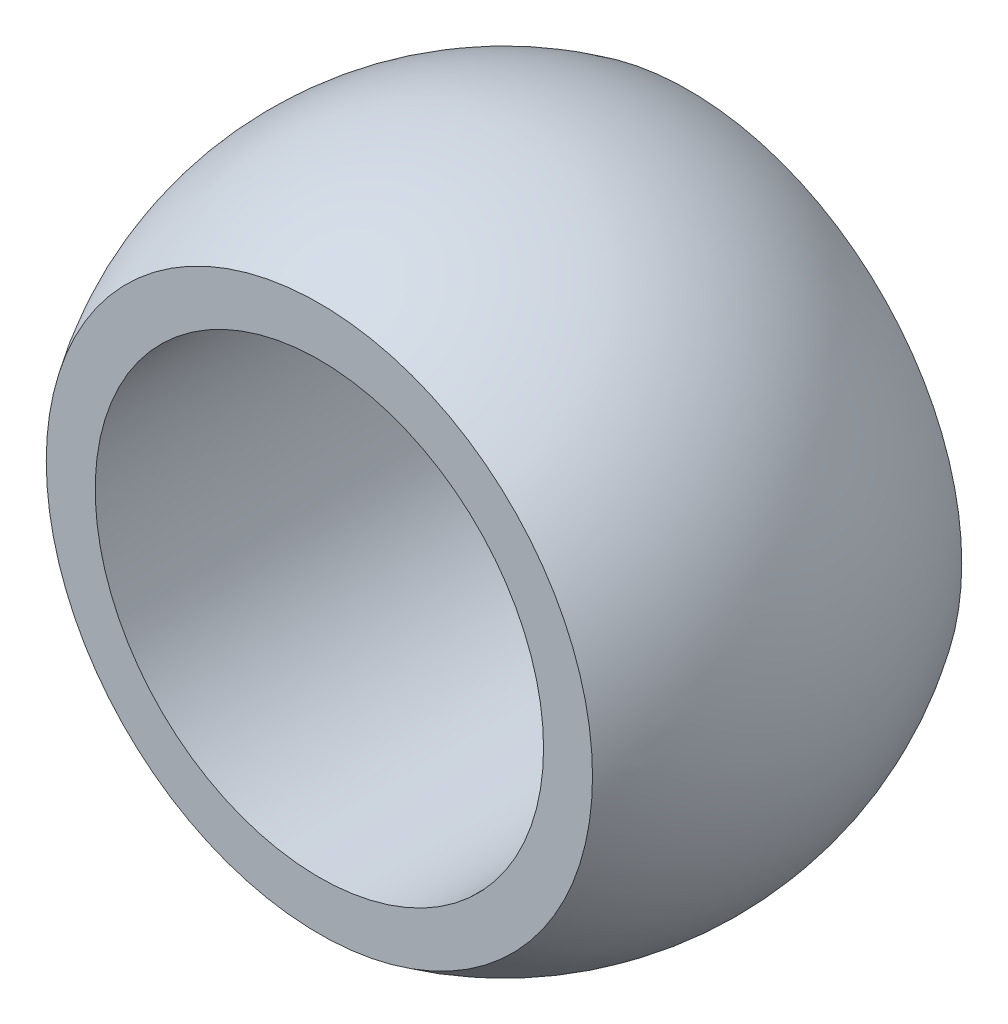
ISO-10303-21;
HEADER;
FILE_DESCRIPTION(('STEP AP214'),'2;1');
FILE_NAME('part.step','',(''),(''),'','','');
FILE_SCHEMA(('AUTOMOTIVE_DESIGN { 1 0 10303 214 1 1 1 1 }'));
ENDSEC;
DATA;
#1=APPLICATION_CONTEXT('core data for automotive mechanical design processes');
#2=APPLICATION_PROTOCOL_DEFINITION('international standard','automotive_design',2000,#1);
#3=PRODUCT_CONTEXT('',#1,'mechanical');
#4=PRODUCT('Part','Part','',(#3));
#5=PRODUCT_RELATED_PRODUCT_CATEGORY('part','',(#4));
#6=PRODUCT_DEFINITION_FORMATION('','',#4);
#7=PRODUCT_DEFINITION_CONTEXT('part definition',#1,'design');
#8=PRODUCT_DEFINITION('design','',#6,#7);
#9=PRODUCT_DEFINITION_SHAPE('','',#8);
#10=(LENGTH_UNIT() NAMED_UNIT(*) SI_UNIT(.MILLI.,.METRE.));
#11=(NAMED_UNIT(*) PLANE_ANGLE_UNIT() SI_UNIT($,.RADIAN.));
#12=(NAMED_UNIT(*) SI_UNIT($,.STERADIAN.) SOLID_ANGLE_UNIT());
#13=UNCERTAINTY_MEASURE_WITH_UNIT(LENGTH_MEASURE(1.E-05),#10,'distance_accuracy_value','');
#14=(GEOMETRIC_REPRESENTATION_CONTEXT(3) GLOBAL_UNCERTAINTY_ASSIGNED_CONTEXT((#13)) GLOBAL_UNIT_ASSIGNED_CONTEXT((#10,
#11,#12)) REPRESENTATION_CONTEXT('',''));
#15=CARTESIAN_POINT('',(0.,0.,0.));
#16=DIRECTION('',(0.,0.,1.));
#17=DIRECTION('',(1.,0.,0.));
#18=AXIS2_PLACEMENT_3D('',#15,#16,#17);
#19=CARTESIAN_POINT('',(0.,0.,0.));
#20=DIRECTION('',(0.,0.999999999999999,0.));
#21=DIRECTION('',(1.,0.,0.));
#22=AXIS2_PLACEMENT_3D('',#19,#20,#21);
#23=SPHERICAL_SURFACE('',#22,12.5);
#24=CARTESIAN_POINT('',(0.,0.,0.));
#25=DIRECTION('',(0.,0.,1.));
#26=DIRECTION('',(1.,0.,0.));
#27=AXIS2_PLACEMENT_3D('',#24,#25,#26);
#28=SPHERICAL_SURFACE('',#27,12.5);
#29=CARTESIAN_POINT('',(0.,0.,-6.99999999999996));
#30=DIRECTION('',(0.,0.,0.999999999999999));
#31=DIRECTION('',(1.,0.,0.));
#32=AXIS2_PLACEMENT_3D('',#29,#30,#31);
#33=CIRCLE('',#32,10.356157588604);
#34=CARTESIAN_POINT('',(10.356157588604,0.,-6.99999999999996));
#35=VERTEX_POINT('',#34);
#36=EDGE_CURVE('E37',#35,#35,#33,.T.);
#37=ORIENTED_EDGE('',*,*,#36,.T.);
#38=EDGE_LOOP('',(#37));
#39=FACE_BOUND('',#38,.T.);
#40=CARTESIAN_POINT('',(0.,0.,7.00000000000007));
#41=DIRECTION('',(0.,0.,-0.999999999999998));
#42=DIRECTION('',(-1.,0.,0.));
#43=AXIS2_PLACEMENT_3D('',#40,#41,#42);
#44=CIRCLE('',#43,10.356157588604);
#45=CARTESIAN_POINT('',(-10.356157588604,0.,7.00000000000007));
#46=VERTEX_POINT('',#45);
#47=EDGE_CURVE('E10',#46,#46,#44,.T.);
#48=ORIENTED_EDGE('',*,*,#47,.T.);
#49=EDGE_LOOP('',(#48));
#50=FACE_BOUND('',#49,.T.);
#51=ADVANCED_FACE('F34',(#39,#50),#28,.T.);
#52=CARTESIAN_POINT('',(-11.,-28.,7.00000000000003));
#53=DIRECTION('',(0.,0.,-0.999999999999998));
#54=DIRECTION('',(-1.,0.,0.));
#55=AXIS2_PLACEMENT_3D('',#52,#53,#54);
#56=PLANE('',#55);
#57=CARTESIAN_POINT('',(0.,0.,7.00000000000007));
#58=DIRECTION('',(0.,0.,0.999999999999998));
#59=DIRECTION('',(1.,0.,0.));
#60=AXIS2_PLACEMENT_3D('',#57,#58,#59);
#61=CIRCLE('',#60,8.5);
#62=CARTESIAN_POINT('',(8.5,0.,7.00000000000006));
#63=VERTEX_POINT('',#62);
#64=EDGE_CURVE('E52',#63,#63,#61,.T.);
#65=ORIENTED_EDGE('',*,*,#64,.F.);
#66=EDGE_LOOP('',(#65));
#67=FACE_BOUND('',#66,.T.);
#68=ORIENTED_EDGE('',*,*,#47,.F.);
#69=EDGE_LOOP('',(#68));
#70=FACE_BOUND('',#69,.T.);
#71=ADVANCED_FACE('F60',(#67,#70),#56,.F.);
#72=CARTESIAN_POINT('',(-11.,-28.,-6.99999999999992));
#73=DIRECTION('',(0.,0.,0.999999999999999));
#74=DIRECTION('',(1.,0.,0.));
#75=AXIS2_PLACEMENT_3D('',#72,#73,#74);
#76=PLANE('',#75);
#77=CARTESIAN_POINT('',(0.,0.,-6.99999999999996));
#78=DIRECTION('',(0.,0.,0.999999999999998));
#79=DIRECTION('',(1.,0.,0.));
#80=AXIS2_PLACEMENT_3D('',#77,#78,#79);
#81=CIRCLE('',#80,8.5);
#82=CARTESIAN_POINT('',(8.49999999999997,0.,-6.99999999999996));
#83=VERTEX_POINT('',#82);
#84=EDGE_CURVE('E47',#83,#83,#81,.T.);
#85=ORIENTED_EDGE('',*,*,#84,.T.);
#86=EDGE_LOOP('',(#85));
#87=FACE_BOUND('',#86,.T.);
#88=ORIENTED_EDGE('',*,*,#36,.F.);
#89=EDGE_LOOP('',(#88));
#90=FACE_BOUND('',#89,.T.);
#91=ADVANCED_FACE('F63',(#87,#90),#76,.F.);
#92=CARTESIAN_POINT('',(0.,0.,-6.99999999999996));
#93=DIRECTION('',(0.,0.,0.999999999999998));
#94=DIRECTION('',(1.,0.,0.));
#95=AXIS2_PLACEMENT_3D('',#92,#93,#94);
#96=CYLINDRICAL_SURFACE('',#95,8.5);
#97=ORIENTED_EDGE('',*,*,#84,.F.);
#98=EDGE_LOOP('',(#97));
#99=FACE_BOUND('',#98,.T.);
#100=ORIENTED_EDGE('',*,*,#64,.T.);
#101=EDGE_LOOP('',(#100));
#102=FACE_BOUND('',#101,.T.);
#103=ADVANCED_FACE('F58',(#99,#102),#96,.F.);
#104=CLOSED_SHELL('',(#51,#71,#91,#103));
#105=MANIFOLD_SOLID_BREP('B2',#104);
#106=ADVANCED_BREP_SHAPE_REPRESENTATION('',(#18,#105),#14);
#107=SHAPE_DEFINITION_REPRESENTATION(#9,#106);
ENDSEC;
END-ISO-10303-21;
